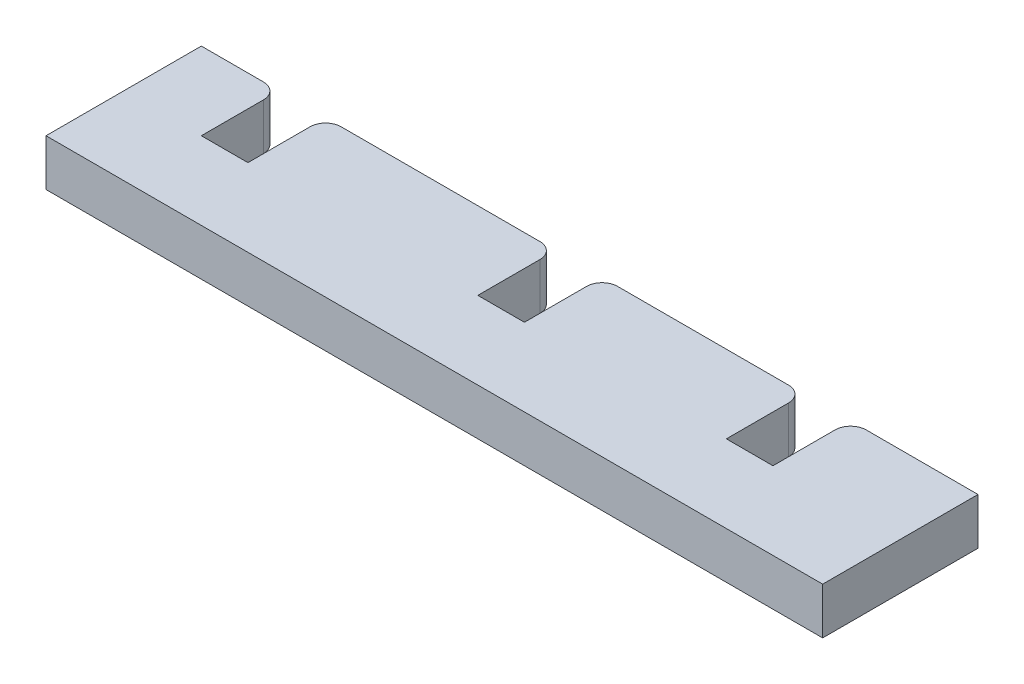
ISO-10303-21;
HEADER;
FILE_DESCRIPTION(('STEP AP214'),'2;1');
FILE_NAME('part.step','',(''),(''),'','','');
FILE_SCHEMA(('AUTOMOTIVE_DESIGN { 1 0 10303 214 1 1 1 1 }'));
ENDSEC;
DATA;
#1=APPLICATION_CONTEXT('core data for automotive mechanical design processes');
#2=APPLICATION_PROTOCOL_DEFINITION('international standard','automotive_design',2000,#1);
#3=PRODUCT_CONTEXT('',#1,'mechanical');
#4=PRODUCT('Part','Part','',(#3));
#5=PRODUCT_RELATED_PRODUCT_CATEGORY('part','',(#4));
#6=PRODUCT_DEFINITION_FORMATION('','',#4);
#7=PRODUCT_DEFINITION_CONTEXT('part definition',#1,'design');
#8=PRODUCT_DEFINITION('design','',#6,#7);
#9=PRODUCT_DEFINITION_SHAPE('','',#8);
#10=(LENGTH_UNIT() NAMED_UNIT(*) SI_UNIT(.MILLI.,.METRE.));
#11=(NAMED_UNIT(*) PLANE_ANGLE_UNIT() SI_UNIT($,.RADIAN.));
#12=(NAMED_UNIT(*) SI_UNIT($,.STERADIAN.) SOLID_ANGLE_UNIT());
#13=UNCERTAINTY_MEASURE_WITH_UNIT(LENGTH_MEASURE(1.E-05),#10,'distance_accuracy_value','');
#14=(GEOMETRIC_REPRESENTATION_CONTEXT(3) GLOBAL_UNCERTAINTY_ASSIGNED_CONTEXT((#13)) GLOBAL_UNIT_ASSIGNED_CONTEXT((#10,
#11,#12)) REPRESENTATION_CONTEXT('',''));
#15=CARTESIAN_POINT('',(0.,0.,0.));
#16=DIRECTION('',(0.,0.,1.));
#17=DIRECTION('',(1.,0.,0.));
#18=AXIS2_PLACEMENT_3D('',#15,#16,#17);
#19=CARTESIAN_POINT('',(0.,0.,0.));
#20=DIRECTION('',(0.,0.,-1.));
#21=DIRECTION('',(-1.,0.,0.));
#22=AXIS2_PLACEMENT_3D('',#19,#20,#21);
#23=PLANE('',#22);
#24=DIRECTION('',(1.,0.,0.));
#25=VECTOR('',#24,1.);
#26=CARTESIAN_POINT('',(0.,0.,0.));
#27=LINE('',#26,#25);
#28=CARTESIAN_POINT('',(42.8,0.,0.));
#29=VERTEX_POINT('',#28);
#30=CARTESIAN_POINT('',(50.,0.,0.));
#31=VERTEX_POINT('',#30);
#32=EDGE_CURVE('E273',#29,#31,#27,.T.);
#33=ORIENTED_EDGE('',*,*,#32,.F.);
#34=DIRECTION('',(0.,-1.,0.));
#35=VECTOR('',#34,1.);
#36=CARTESIAN_POINT('',(42.8,3.,0.));
#37=LINE('',#36,#35);
#38=CARTESIAN_POINT('',(42.8,3.,0.));
#39=VERTEX_POINT('',#38);
#40=EDGE_CURVE('E11',#29,#39,#37,.F.);
#41=ORIENTED_EDGE('',*,*,#40,.T.);
#42=DIRECTION('',(-1.,0.,0.));
#43=VECTOR('',#42,1.);
#44=CARTESIAN_POINT('',(0.,3.,0.));
#45=LINE('',#44,#43);
#46=CARTESIAN_POINT('',(50.,3.,0.));
#47=VERTEX_POINT('',#46);
#48=EDGE_CURVE('E263',#47,#39,#45,.T.);
#49=ORIENTED_EDGE('',*,*,#48,.F.);
#50=DIRECTION('',(0.,1.,0.));
#51=VECTOR('',#50,1.);
#52=CARTESIAN_POINT('',(50.,0.,0.));
#53=LINE('',#52,#51);
#54=EDGE_CURVE('E277',#31,#47,#53,.T.);
#55=ORIENTED_EDGE('',*,*,#54,.F.);
#56=EDGE_LOOP('',(#33,#41,#49,#55));
#57=FACE_BOUND('',#56,.T.);
#58=ADVANCED_FACE('F35',(#57),#23,.T.);
#59=CARTESIAN_POINT('',(26.8,0.,0.));
#60=VERTEX_POINT('',#59);
#61=CARTESIAN_POINT('',(37.8,0.,0.));
#62=VERTEX_POINT('',#61);
#63=EDGE_CURVE('E279',#60,#62,#27,.T.);
#64=ORIENTED_EDGE('',*,*,#63,.F.);
#65=DIRECTION('',(0.,-1.,0.));
#66=VECTOR('',#65,1.);
#67=CARTESIAN_POINT('',(26.8,3.,0.));
#68=LINE('',#67,#66);
#69=CARTESIAN_POINT('',(26.8,3.,0.));
#70=VERTEX_POINT('',#69);
#71=EDGE_CURVE('E338',#60,#70,#68,.F.);
#72=ORIENTED_EDGE('',*,*,#71,.T.);
#73=CARTESIAN_POINT('',(37.8,3.,0.));
#74=VERTEX_POINT('',#73);
#75=EDGE_CURVE('E284',#74,#70,#45,.T.);
#76=ORIENTED_EDGE('',*,*,#75,.F.);
#77=DIRECTION('',(0.,1.,0.));
#78=VECTOR('',#77,1.);
#79=CARTESIAN_POINT('',(37.8,0.,0.));
#80=LINE('',#79,#78);
#81=EDGE_CURVE('E58',#74,#62,#80,.F.);
#82=ORIENTED_EDGE('',*,*,#81,.T.);
#83=EDGE_LOOP('',(#64,#72,#76,#82));
#84=FACE_BOUND('',#83,.T.);
#85=ADVANCED_FACE('F384',(#84),#23,.T.);
#86=CARTESIAN_POINT('',(9.,0.,0.));
#87=VERTEX_POINT('',#86);
#88=CARTESIAN_POINT('',(21.8,0.,0.));
#89=VERTEX_POINT('',#88);
#90=EDGE_CURVE('E278',#87,#89,#27,.T.);
#91=ORIENTED_EDGE('',*,*,#90,.F.);
#92=DIRECTION('',(0.,-1.,0.));
#93=VECTOR('',#92,1.);
#94=CARTESIAN_POINT('',(9.,3.,0.));
#95=LINE('',#94,#93);
#96=CARTESIAN_POINT('',(9.,3.,0.));
#97=VERTEX_POINT('',#96);
#98=EDGE_CURVE('E329',#87,#97,#95,.F.);
#99=ORIENTED_EDGE('',*,*,#98,.T.);
#100=CARTESIAN_POINT('',(21.8,3.,0.));
#101=VERTEX_POINT('',#100);
#102=EDGE_CURVE('E388',#101,#97,#45,.T.);
#103=ORIENTED_EDGE('',*,*,#102,.F.);
#104=DIRECTION('',(0.,1.,0.));
#105=VECTOR('',#104,1.);
#106=CARTESIAN_POINT('',(21.8,0.,0.));
#107=LINE('',#106,#105);
#108=EDGE_CURVE('E327',#101,#89,#107,.F.);
#109=ORIENTED_EDGE('',*,*,#108,.T.);
#110=EDGE_LOOP('',(#91,#99,#103,#109));
#111=FACE_BOUND('',#110,.T.);
#112=ADVANCED_FACE('F421',(#111),#23,.T.);
#113=CARTESIAN_POINT('',(0.,0.,10.));
#114=DIRECTION('',(1.,0.,0.));
#115=DIRECTION('',(0.,0.,-1.));
#116=AXIS2_PLACEMENT_3D('',#113,#114,#115);
#117=PLANE('',#116);
#118=DIRECTION('',(0.,-1.,0.));
#119=VECTOR('',#118,1.);
#120=CARTESIAN_POINT('',(0.,0.,0.));
#121=LINE('',#120,#119);
#122=CARTESIAN_POINT('',(0.,3.,0.));
#123=VERTEX_POINT('',#122);
#124=CARTESIAN_POINT('',(0.,0.,0.));
#125=VERTEX_POINT('',#124);
#126=EDGE_CURVE('E270',#123,#125,#121,.T.);
#127=ORIENTED_EDGE('',*,*,#126,.T.);
#128=DIRECTION('',(0.,0.,-1.));
#129=VECTOR('',#128,1.);
#130=CARTESIAN_POINT('',(0.,0.,10.));
#131=LINE('',#130,#129);
#132=CARTESIAN_POINT('',(0.,0.,10.));
#133=VERTEX_POINT('',#132);
#134=EDGE_CURVE('E293',#133,#125,#131,.T.);
#135=ORIENTED_EDGE('',*,*,#134,.F.);
#136=DIRECTION('',(0.,-1.,0.));
#137=VECTOR('',#136,1.);
#138=CARTESIAN_POINT('',(0.,0.,10.));
#139=LINE('',#138,#137);
#140=CARTESIAN_POINT('',(0.,3.,10.));
#141=VERTEX_POINT('',#140);
#142=EDGE_CURVE('E259',#141,#133,#139,.T.);
#143=ORIENTED_EDGE('',*,*,#142,.F.);
#144=DIRECTION('',(0.,0.,-1.));
#145=VECTOR('',#144,1.);
#146=CARTESIAN_POINT('',(0.,3.,10.));
#147=LINE('',#146,#145);
#148=EDGE_CURVE('E269',#141,#123,#147,.T.);
#149=ORIENTED_EDGE('',*,*,#148,.T.);
#150=EDGE_LOOP('',(#127,#135,#143,#149));
#151=FACE_BOUND('',#150,.T.);
#152=ADVANCED_FACE('F398',(#151),#117,.F.);
#153=CARTESIAN_POINT('',(0.,0.,10.));
#154=DIRECTION('',(0.,1.,0.));
#155=DIRECTION('',(0.,0.,1.));
#156=AXIS2_PLACEMENT_3D('',#153,#154,#155);
#157=PLANE('',#156);
#158=CARTESIAN_POINT('',(4.,0.,0.));
#159=VERTEX_POINT('',#158);
#160=EDGE_CURVE('E275',#125,#159,#27,.T.);
#161=ORIENTED_EDGE('',*,*,#160,.T.);
#162=CARTESIAN_POINT('',(4.,0.,1.));
#163=DIRECTION('',(0.,1.,0.));
#164=DIRECTION('',(0.,0.,1.));
#165=AXIS2_PLACEMENT_3D('',#162,#163,#164);
#166=CIRCLE('',#165,1.);
#167=CARTESIAN_POINT('',(5.,0.,1.));
#168=VERTEX_POINT('',#167);
#169=EDGE_CURVE('E322',#159,#168,#166,.F.);
#170=ORIENTED_EDGE('',*,*,#169,.T.);
#171=DIRECTION('',(0.,0.,-1.));
#172=VECTOR('',#171,1.);
#173=CARTESIAN_POINT('',(5.,0.,5.));
#174=LINE('',#173,#172);
#175=CARTESIAN_POINT('',(5.,0.,5.));
#176=VERTEX_POINT('',#175);
#177=EDGE_CURVE('E248',#176,#168,#174,.T.);
#178=ORIENTED_EDGE('',*,*,#177,.F.);
#179=DIRECTION('',(-1.,0.,0.));
#180=VECTOR('',#179,1.);
#181=CARTESIAN_POINT('',(5.,0.,5.));
#182=LINE('',#181,#180);
#183=CARTESIAN_POINT('',(8.,0.,5.));
#184=VERTEX_POINT('',#183);
#185=EDGE_CURVE('E237',#184,#176,#182,.T.);
#186=ORIENTED_EDGE('',*,*,#185,.F.);
#187=DIRECTION('',(0.,0.,-1.));
#188=VECTOR('',#187,1.);
#189=CARTESIAN_POINT('',(8.,0.,5.));
#190=LINE('',#189,#188);
#191=CARTESIAN_POINT('',(8.,0.,1.));
#192=VERTEX_POINT('',#191);
#193=EDGE_CURVE('E218',#184,#192,#190,.T.);
#194=ORIENTED_EDGE('',*,*,#193,.T.);
#195=CARTESIAN_POINT('',(9.,0.,1.));
#196=DIRECTION('',(0.,1.,0.));
#197=DIRECTION('',(0.,0.,1.));
#198=AXIS2_PLACEMENT_3D('',#195,#196,#197);
#199=CIRCLE('',#198,1.);
#200=EDGE_CURVE('E320',#192,#87,#199,.F.);
#201=ORIENTED_EDGE('',*,*,#200,.T.);
#202=ORIENTED_EDGE('',*,*,#90,.T.);
#203=CARTESIAN_POINT('',(21.8,0.,1.));
#204=DIRECTION('',(0.,1.,0.));
#205=DIRECTION('',(0.,0.,1.));
#206=AXIS2_PLACEMENT_3D('',#203,#204,#205);
#207=CIRCLE('',#206,1.);
#208=CARTESIAN_POINT('',(22.8,0.,1.));
#209=VERTEX_POINT('',#208);
#210=EDGE_CURVE('E318',#89,#209,#207,.F.);
#211=ORIENTED_EDGE('',*,*,#210,.T.);
#212=DIRECTION('',(0.,0.,-1.));
#213=VECTOR('',#212,1.);
#214=CARTESIAN_POINT('',(22.8,0.,5.));
#215=LINE('',#214,#213);
#216=CARTESIAN_POINT('',(22.8,0.,5.));
#217=VERTEX_POINT('',#216);
#218=EDGE_CURVE('E226',#217,#209,#215,.T.);
#219=ORIENTED_EDGE('',*,*,#218,.F.);
#220=DIRECTION('',(-1.,0.,0.));
#221=VECTOR('',#220,1.);
#222=CARTESIAN_POINT('',(22.8,0.,5.));
#223=LINE('',#222,#221);
#224=CARTESIAN_POINT('',(25.8,0.,5.));
#225=VERTEX_POINT('',#224);
#226=EDGE_CURVE('E214',#225,#217,#223,.T.);
#227=ORIENTED_EDGE('',*,*,#226,.F.);
#228=DIRECTION('',(0.,0.,-1.));
#229=VECTOR('',#228,1.);
#230=CARTESIAN_POINT('',(25.8,0.,5.));
#231=LINE('',#230,#229);
#232=CARTESIAN_POINT('',(25.8,0.,1.));
#233=VERTEX_POINT('',#232);
#234=EDGE_CURVE('E204',#225,#233,#231,.T.);
#235=ORIENTED_EDGE('',*,*,#234,.T.);
#236=CARTESIAN_POINT('',(26.8,0.,1.));
#237=DIRECTION('',(0.,1.,0.));
#238=DIRECTION('',(0.,0.,1.));
#239=AXIS2_PLACEMENT_3D('',#236,#237,#238);
#240=CIRCLE('',#239,1.);
#241=EDGE_CURVE('E316',#233,#60,#240,.F.);
#242=ORIENTED_EDGE('',*,*,#241,.T.);
#243=ORIENTED_EDGE('',*,*,#63,.T.);
#244=CARTESIAN_POINT('',(37.8,0.,1.));
#245=DIRECTION('',(0.,1.,0.));
#246=DIRECTION('',(0.,0.,1.));
#247=AXIS2_PLACEMENT_3D('',#244,#245,#246);
#248=CIRCLE('',#247,1.);
#249=CARTESIAN_POINT('',(38.8,0.,1.));
#250=VERTEX_POINT('',#249);
#251=EDGE_CURVE('E50',#62,#250,#248,.F.);
#252=ORIENTED_EDGE('',*,*,#251,.T.);
#253=DIRECTION('',(0.,0.,-1.));
#254=VECTOR('',#253,1.);
#255=CARTESIAN_POINT('',(38.8,0.,5.));
#256=LINE('',#255,#254);
#257=CARTESIAN_POINT('',(38.8,0.,5.));
#258=VERTEX_POINT('',#257);
#259=EDGE_CURVE('E189',#258,#250,#256,.T.);
#260=ORIENTED_EDGE('',*,*,#259,.F.);
#261=DIRECTION('',(-1.,0.,0.));
#262=VECTOR('',#261,1.);
#263=CARTESIAN_POINT('',(38.8,0.,5.));
#264=LINE('',#263,#262);
#265=CARTESIAN_POINT('',(41.8,0.,5.));
#266=VERTEX_POINT('',#265);
#267=EDGE_CURVE('E196',#266,#258,#264,.T.);
#268=ORIENTED_EDGE('',*,*,#267,.F.);
#269=DIRECTION('',(0.,0.,-1.));
#270=VECTOR('',#269,1.);
#271=CARTESIAN_POINT('',(41.8,0.,5.));
#272=LINE('',#271,#270);
#273=CARTESIAN_POINT('',(41.8,0.,1.));
#274=VERTEX_POINT('',#273);
#275=EDGE_CURVE('E274',#266,#274,#272,.T.);
#276=ORIENTED_EDGE('',*,*,#275,.T.);
#277=CARTESIAN_POINT('',(42.8,0.,1.));
#278=DIRECTION('',(0.,1.,0.));
#279=DIRECTION('',(0.,0.,1.));
#280=AXIS2_PLACEMENT_3D('',#277,#278,#279);
#281=CIRCLE('',#280,1.);
#282=EDGE_CURVE('E313',#274,#29,#281,.F.);
#283=ORIENTED_EDGE('',*,*,#282,.T.);
#284=ORIENTED_EDGE('',*,*,#32,.T.);
#285=DIRECTION('',(0.,0.,-1.));
#286=VECTOR('',#285,1.);
#287=CARTESIAN_POINT('',(50.,0.,10.));
#288=LINE('',#287,#286);
#289=CARTESIAN_POINT('',(50.,0.,10.));
#290=VERTEX_POINT('',#289);
#291=EDGE_CURVE('E290',#290,#31,#288,.T.);
#292=ORIENTED_EDGE('',*,*,#291,.F.);
#293=DIRECTION('',(1.,0.,0.));
#294=VECTOR('',#293,1.);
#295=CARTESIAN_POINT('',(0.,0.,10.));
#296=LINE('',#295,#294);
#297=EDGE_CURVE('E262',#133,#290,#296,.T.);
#298=ORIENTED_EDGE('',*,*,#297,.F.);
#299=ORIENTED_EDGE('',*,*,#134,.T.);
#300=EDGE_LOOP('',(#161,#170,#178,#186,#194,#201,#202,#211,#219,#227,#235,#242,#243,#252,#260,
#268,#276,#283,#284,#292,#298,#299));
#301=FACE_BOUND('',#300,.T.);
#302=ADVANCED_FACE('F207',(#301),#157,.F.);
#303=CARTESIAN_POINT('',(50.,0.,10.));
#304=DIRECTION('',(-1.,0.,0.));
#305=DIRECTION('',(0.,0.,1.));
#306=AXIS2_PLACEMENT_3D('',#303,#304,#305);
#307=PLANE('',#306);
#308=ORIENTED_EDGE('',*,*,#54,.T.);
#309=DIRECTION('',(0.,0.,-1.));
#310=VECTOR('',#309,1.);
#311=CARTESIAN_POINT('',(50.,3.,10.));
#312=LINE('',#311,#310);
#313=CARTESIAN_POINT('',(50.,3.,10.));
#314=VERTEX_POINT('',#313);
#315=EDGE_CURVE('E287',#314,#47,#312,.T.);
#316=ORIENTED_EDGE('',*,*,#315,.F.);
#317=DIRECTION('',(0.,1.,0.));
#318=VECTOR('',#317,1.);
#319=CARTESIAN_POINT('',(50.,0.,10.));
#320=LINE('',#319,#318);
#321=EDGE_CURVE('E265',#290,#314,#320,.T.);
#322=ORIENTED_EDGE('',*,*,#321,.F.);
#323=ORIENTED_EDGE('',*,*,#291,.T.);
#324=EDGE_LOOP('',(#308,#316,#322,#323));
#325=FACE_BOUND('',#324,.T.);
#326=ADVANCED_FACE('F407',(#325),#307,.F.);
#327=CARTESIAN_POINT('',(0.,3.,10.));
#328=DIRECTION('',(0.,-1.,0.));
#329=DIRECTION('',(0.,0.,-1.));
#330=AXIS2_PLACEMENT_3D('',#327,#328,#329);
#331=PLANE('',#330);
#332=DIRECTION('',(0.,0.,-1.));
#333=VECTOR('',#332,1.);
#334=CARTESIAN_POINT('',(5.,3.,5.));
#335=LINE('',#334,#333);
#336=CARTESIAN_POINT('',(5.,3.,5.));
#337=VERTEX_POINT('',#336);
#338=CARTESIAN_POINT('',(5.,3.,1.));
#339=VERTEX_POINT('',#338);
#340=EDGE_CURVE('E254',#337,#339,#335,.T.);
#341=ORIENTED_EDGE('',*,*,#340,.T.);
#342=CARTESIAN_POINT('',(4.,3.,1.));
#343=DIRECTION('',(0.,-1.,0.));
#344=DIRECTION('',(0.,0.,-1.));
#345=AXIS2_PLACEMENT_3D('',#342,#343,#344);
#346=CIRCLE('',#345,1.);
#347=CARTESIAN_POINT('',(4.,3.,0.));
#348=VERTEX_POINT('',#347);
#349=EDGE_CURVE('E309',#339,#348,#346,.F.);
#350=ORIENTED_EDGE('',*,*,#349,.T.);
#351=EDGE_CURVE('E281',#348,#123,#45,.T.);
#352=ORIENTED_EDGE('',*,*,#351,.T.);
#353=ORIENTED_EDGE('',*,*,#148,.F.);
#354=DIRECTION('',(-1.,0.,0.));
#355=VECTOR('',#354,1.);
#356=CARTESIAN_POINT('',(0.,3.,10.));
#357=LINE('',#356,#355);
#358=EDGE_CURVE('E267',#314,#141,#357,.T.);
#359=ORIENTED_EDGE('',*,*,#358,.F.);
#360=ORIENTED_EDGE('',*,*,#315,.T.);
#361=ORIENTED_EDGE('',*,*,#48,.T.);
#362=CARTESIAN_POINT('',(42.8,3.,1.));
#363=DIRECTION('',(0.,-1.,0.));
#364=DIRECTION('',(0.,0.,-1.));
#365=AXIS2_PLACEMENT_3D('',#362,#363,#364);
#366=CIRCLE('',#365,1.);
#367=CARTESIAN_POINT('',(41.8,3.,1.));
#368=VERTEX_POINT('',#367);
#369=EDGE_CURVE('E299',#39,#368,#366,.F.);
#370=ORIENTED_EDGE('',*,*,#369,.T.);
#371=DIRECTION('',(0.,0.,-1.));
#372=VECTOR('',#371,1.);
#373=CARTESIAN_POINT('',(41.8,3.,5.));
#374=LINE('',#373,#372);
#375=CARTESIAN_POINT('',(41.8,3.,5.));
#376=VERTEX_POINT('',#375);
#377=EDGE_CURVE('E209',#376,#368,#374,.T.);
#378=ORIENTED_EDGE('',*,*,#377,.F.);
#379=DIRECTION('',(1.,0.,0.));
#380=VECTOR('',#379,1.);
#381=CARTESIAN_POINT('',(41.8,3.,5.));
#382=LINE('',#381,#380);
#383=CARTESIAN_POINT('',(38.8,3.,5.));
#384=VERTEX_POINT('',#383);
#385=EDGE_CURVE('E195',#384,#376,#382,.T.);
#386=ORIENTED_EDGE('',*,*,#385,.F.);
#387=DIRECTION('',(0.,0.,-1.));
#388=VECTOR('',#387,1.);
#389=CARTESIAN_POINT('',(38.8,3.,5.));
#390=LINE('',#389,#388);
#391=CARTESIAN_POINT('',(38.8,3.,1.));
#392=VERTEX_POINT('',#391);
#393=EDGE_CURVE('E192',#384,#392,#390,.T.);
#394=ORIENTED_EDGE('',*,*,#393,.T.);
#395=CARTESIAN_POINT('',(37.8,3.,1.));
#396=DIRECTION('',(0.,-1.,0.));
#397=DIRECTION('',(0.,0.,-1.));
#398=AXIS2_PLACEMENT_3D('',#395,#396,#397);
#399=CIRCLE('',#398,1.);
#400=EDGE_CURVE('E301',#392,#74,#399,.F.);
#401=ORIENTED_EDGE('',*,*,#400,.T.);
#402=ORIENTED_EDGE('',*,*,#75,.T.);
#403=CARTESIAN_POINT('',(26.8,3.,1.));
#404=DIRECTION('',(0.,-1.,0.));
#405=DIRECTION('',(0.,0.,-1.));
#406=AXIS2_PLACEMENT_3D('',#403,#404,#405);
#407=CIRCLE('',#406,1.);
#408=CARTESIAN_POINT('',(25.8,3.,1.));
#409=VERTEX_POINT('',#408);
#410=EDGE_CURVE('E303',#70,#409,#407,.F.);
#411=ORIENTED_EDGE('',*,*,#410,.T.);
#412=DIRECTION('',(0.,0.,-1.));
#413=VECTOR('',#412,1.);
#414=CARTESIAN_POINT('',(25.8,3.,5.));
#415=LINE('',#414,#413);
#416=CARTESIAN_POINT('',(25.8,3.,5.));
#417=VERTEX_POINT('',#416);
#418=EDGE_CURVE('E229',#417,#409,#415,.T.);
#419=ORIENTED_EDGE('',*,*,#418,.F.);
#420=DIRECTION('',(1.,0.,0.));
#421=VECTOR('',#420,1.);
#422=CARTESIAN_POINT('',(25.8,3.,5.));
#423=LINE('',#422,#421);
#424=CARTESIAN_POINT('',(22.8,3.,5.));
#425=VERTEX_POINT('',#424);
#426=EDGE_CURVE('E221',#425,#417,#423,.T.);
#427=ORIENTED_EDGE('',*,*,#426,.F.);
#428=DIRECTION('',(0.,0.,-1.));
#429=VECTOR('',#428,1.);
#430=CARTESIAN_POINT('',(22.8,3.,5.));
#431=LINE('',#430,#429);
#432=CARTESIAN_POINT('',(22.8,3.,1.));
#433=VERTEX_POINT('',#432);
#434=EDGE_CURVE('E232',#425,#433,#431,.T.);
#435=ORIENTED_EDGE('',*,*,#434,.T.);
#436=CARTESIAN_POINT('',(21.8,3.,1.));
#437=DIRECTION('',(0.,-1.,0.));
#438=DIRECTION('',(0.,0.,-1.));
#439=AXIS2_PLACEMENT_3D('',#436,#437,#438);
#440=CIRCLE('',#439,1.);
#441=EDGE_CURVE('E305',#433,#101,#440,.F.);
#442=ORIENTED_EDGE('',*,*,#441,.T.);
#443=ORIENTED_EDGE('',*,*,#102,.T.);
#444=CARTESIAN_POINT('',(9.,3.,1.));
#445=DIRECTION('',(0.,-1.,0.));
#446=DIRECTION('',(0.,0.,-1.));
#447=AXIS2_PLACEMENT_3D('',#444,#445,#446);
#448=CIRCLE('',#447,1.);
#449=CARTESIAN_POINT('',(8.,3.,1.));
#450=VERTEX_POINT('',#449);
#451=EDGE_CURVE('E307',#97,#450,#448,.F.);
#452=ORIENTED_EDGE('',*,*,#451,.T.);
#453=DIRECTION('',(0.,0.,-1.));
#454=VECTOR('',#453,1.);
#455=CARTESIAN_POINT('',(8.,3.,5.));
#456=LINE('',#455,#454);
#457=CARTESIAN_POINT('',(8.,3.,5.));
#458=VERTEX_POINT('',#457);
#459=EDGE_CURVE('E251',#458,#450,#456,.T.);
#460=ORIENTED_EDGE('',*,*,#459,.F.);
#461=DIRECTION('',(1.,0.,0.));
#462=VECTOR('',#461,1.);
#463=CARTESIAN_POINT('',(8.,3.,5.));
#464=LINE('',#463,#462);
#465=EDGE_CURVE('E243',#337,#458,#464,.T.);
#466=ORIENTED_EDGE('',*,*,#465,.F.);
#467=EDGE_LOOP('',(#341,#350,#352,#353,#359,#360,#361,#370,#378,#386,#394,#401,#402,#411,#419,
#427,#435,#442,#443,#452,#460,#466));
#468=FACE_BOUND('',#467,.T.);
#469=ADVANCED_FACE('F353',(#468),#331,.F.);
#470=CARTESIAN_POINT('',(0.,0.,10.));
#471=DIRECTION('',(0.,0.,-1.));
#472=DIRECTION('',(-1.,0.,0.));
#473=AXIS2_PLACEMENT_3D('',#470,#471,#472);
#474=PLANE('',#473);
#475=ORIENTED_EDGE('',*,*,#142,.T.);
#476=ORIENTED_EDGE('',*,*,#297,.T.);
#477=ORIENTED_EDGE('',*,*,#321,.T.);
#478=ORIENTED_EDGE('',*,*,#358,.T.);
#479=EDGE_LOOP('',(#475,#476,#477,#478));
#480=FACE_BOUND('',#479,.T.);
#481=ADVANCED_FACE('F404',(#480),#474,.F.);
#482=ORIENTED_EDGE('',*,*,#351,.F.);
#483=DIRECTION('',(0.,1.,0.));
#484=VECTOR('',#483,1.);
#485=CARTESIAN_POINT('',(4.,0.,0.));
#486=LINE('',#485,#484);
#487=EDGE_CURVE('E311',#348,#159,#486,.F.);
#488=ORIENTED_EDGE('',*,*,#487,.T.);
#489=ORIENTED_EDGE('',*,*,#160,.F.);
#490=ORIENTED_EDGE('',*,*,#126,.F.);
#491=EDGE_LOOP('',(#482,#488,#489,#490));
#492=FACE_BOUND('',#491,.T.);
#493=ADVANCED_FACE('F400',(#492),#23,.T.);
#494=CARTESIAN_POINT('',(8.,3.,5.));
#495=DIRECTION('',(1.,0.,0.));
#496=DIRECTION('',(0.,0.,-1.));
#497=AXIS2_PLACEMENT_3D('',#494,#495,#496);
#498=PLANE('',#497);
#499=ORIENTED_EDGE('',*,*,#459,.T.);
#500=DIRECTION('',(0.,-1.,0.));
#501=VECTOR('',#500,1.);
#502=CARTESIAN_POINT('',(8.,0.,1.));
#503=LINE('',#502,#501);
#504=EDGE_CURVE('E324',#450,#192,#503,.T.);
#505=ORIENTED_EDGE('',*,*,#504,.T.);
#506=ORIENTED_EDGE('',*,*,#193,.F.);
#507=DIRECTION('',(0.,-1.,0.));
#508=VECTOR('',#507,1.);
#509=CARTESIAN_POINT('',(8.,3.,5.));
#510=LINE('',#509,#508);
#511=EDGE_CURVE('E245',#458,#184,#510,.T.);
#512=ORIENTED_EDGE('',*,*,#511,.F.);
#513=EDGE_LOOP('',(#499,#505,#506,#512));
#514=FACE_BOUND('',#513,.T.);
#515=ADVANCED_FACE('F424',(#514),#498,.F.);
#516=CARTESIAN_POINT('',(5.,3.,5.));
#517=DIRECTION('',(-1.,0.,0.));
#518=DIRECTION('',(0.,-1.,0.));
#519=AXIS2_PLACEMENT_3D('',#516,#517,#518);
#520=PLANE('',#519);
#521=ORIENTED_EDGE('',*,*,#177,.T.);
#522=DIRECTION('',(0.,1.,0.));
#523=VECTOR('',#522,1.);
#524=CARTESIAN_POINT('',(5.,3.,1.));
#525=LINE('',#524,#523);
#526=EDGE_CURVE('E296',#168,#339,#525,.T.);
#527=ORIENTED_EDGE('',*,*,#526,.T.);
#528=ORIENTED_EDGE('',*,*,#340,.F.);
#529=DIRECTION('',(0.,1.,0.));
#530=VECTOR('',#529,1.);
#531=CARTESIAN_POINT('',(5.,3.,5.));
#532=LINE('',#531,#530);
#533=EDGE_CURVE('E240',#176,#337,#532,.T.);
#534=ORIENTED_EDGE('',*,*,#533,.F.);
#535=EDGE_LOOP('',(#521,#527,#528,#534));
#536=FACE_BOUND('',#535,.T.);
#537=ADVANCED_FACE('F429',(#536),#520,.F.);
#538=CARTESIAN_POINT('',(0.,0.,5.));
#539=DIRECTION('',(0.,0.,-1.));
#540=DIRECTION('',(-1.,0.,0.));
#541=AXIS2_PLACEMENT_3D('',#538,#539,#540);
#542=PLANE('',#541);
#543=ORIENTED_EDGE('',*,*,#185,.T.);
#544=ORIENTED_EDGE('',*,*,#533,.T.);
#545=ORIENTED_EDGE('',*,*,#465,.T.);
#546=ORIENTED_EDGE('',*,*,#511,.T.);
#547=EDGE_LOOP('',(#543,#544,#545,#546));
#548=FACE_BOUND('',#547,.T.);
#549=ADVANCED_FACE('F526',(#548),#542,.T.);
#550=CARTESIAN_POINT('',(25.8,3.,5.));
#551=DIRECTION('',(1.,0.,0.));
#552=DIRECTION('',(0.,0.,-1.));
#553=AXIS2_PLACEMENT_3D('',#550,#551,#552);
#554=PLANE('',#553);
#555=ORIENTED_EDGE('',*,*,#418,.T.);
#556=DIRECTION('',(0.,-1.,0.));
#557=VECTOR('',#556,1.);
#558=CARTESIAN_POINT('',(25.8,0.,1.));
#559=LINE('',#558,#557);
#560=EDGE_CURVE('E334',#409,#233,#559,.T.);
#561=ORIENTED_EDGE('',*,*,#560,.T.);
#562=ORIENTED_EDGE('',*,*,#234,.F.);
#563=DIRECTION('',(0.,-1.,0.));
#564=VECTOR('',#563,1.);
#565=CARTESIAN_POINT('',(25.8,3.,5.));
#566=LINE('',#565,#564);
#567=EDGE_CURVE('E223',#417,#225,#566,.T.);
#568=ORIENTED_EDGE('',*,*,#567,.F.);
#569=EDGE_LOOP('',(#555,#561,#562,#568));
#570=FACE_BOUND('',#569,.T.);
#571=ADVANCED_FACE('F380',(#570),#554,.F.);
#572=CARTESIAN_POINT('',(22.8,3.,5.));
#573=DIRECTION('',(-1.,0.,0.));
#574=DIRECTION('',(0.,0.,1.));
#575=AXIS2_PLACEMENT_3D('',#572,#573,#574);
#576=PLANE('',#575);
#577=ORIENTED_EDGE('',*,*,#218,.T.);
#578=DIRECTION('',(0.,1.,0.));
#579=VECTOR('',#578,1.);
#580=CARTESIAN_POINT('',(22.8,3.,1.));
#581=LINE('',#580,#579);
#582=EDGE_CURVE('E331',#209,#433,#581,.T.);
#583=ORIENTED_EDGE('',*,*,#582,.T.);
#584=ORIENTED_EDGE('',*,*,#434,.F.);
#585=DIRECTION('',(0.,1.,0.));
#586=VECTOR('',#585,1.);
#587=CARTESIAN_POINT('',(22.8,3.,5.));
#588=LINE('',#587,#586);
#589=EDGE_CURVE('E217',#217,#425,#588,.T.);
#590=ORIENTED_EDGE('',*,*,#589,.F.);
#591=EDGE_LOOP('',(#577,#583,#584,#590));
#592=FACE_BOUND('',#591,.T.);
#593=ADVANCED_FACE('F370',(#592),#576,.F.);
#594=CARTESIAN_POINT('',(0.,0.,5.));
#595=DIRECTION('',(0.,0.,-1.));
#596=DIRECTION('',(-1.,0.,0.));
#597=AXIS2_PLACEMENT_3D('',#594,#595,#596);
#598=PLANE('',#597);
#599=ORIENTED_EDGE('',*,*,#226,.T.);
#600=ORIENTED_EDGE('',*,*,#589,.T.);
#601=ORIENTED_EDGE('',*,*,#426,.T.);
#602=ORIENTED_EDGE('',*,*,#567,.T.);
#603=EDGE_LOOP('',(#599,#600,#601,#602));
#604=FACE_BOUND('',#603,.T.);
#605=ADVANCED_FACE('F377',(#604),#598,.T.);
#606=CARTESIAN_POINT('',(41.8,3.,5.));
#607=DIRECTION('',(1.,0.,0.));
#608=DIRECTION('',(0.,0.,-1.));
#609=AXIS2_PLACEMENT_3D('',#606,#607,#608);
#610=PLANE('',#609);
#611=ORIENTED_EDGE('',*,*,#377,.T.);
#612=DIRECTION('',(0.,-1.,0.));
#613=VECTOR('',#612,1.);
#614=CARTESIAN_POINT('',(41.8,0.,1.));
#615=LINE('',#614,#613);
#616=EDGE_CURVE('E43',#368,#274,#615,.T.);
#617=ORIENTED_EDGE('',*,*,#616,.T.);
#618=ORIENTED_EDGE('',*,*,#275,.F.);
#619=DIRECTION('',(0.,-1.,0.));
#620=VECTOR('',#619,1.);
#621=CARTESIAN_POINT('',(41.8,3.,5.));
#622=LINE('',#621,#620);
#623=EDGE_CURVE('E202',#376,#266,#622,.T.);
#624=ORIENTED_EDGE('',*,*,#623,.F.);
#625=EDGE_LOOP('',(#611,#617,#618,#624));
#626=FACE_BOUND('',#625,.T.);
#627=ADVANCED_FACE('F345',(#626),#610,.F.);
#628=CARTESIAN_POINT('',(38.8,3.,5.));
#629=DIRECTION('',(-1.,0.,0.));
#630=DIRECTION('',(0.,0.,1.));
#631=AXIS2_PLACEMENT_3D('',#628,#629,#630);
#632=PLANE('',#631);
#633=ORIENTED_EDGE('',*,*,#259,.T.);
#634=DIRECTION('',(0.,1.,0.));
#635=VECTOR('',#634,1.);
#636=CARTESIAN_POINT('',(38.8,3.,1.));
#637=LINE('',#636,#635);
#638=EDGE_CURVE('E340',#250,#392,#637,.T.);
#639=ORIENTED_EDGE('',*,*,#638,.T.);
#640=ORIENTED_EDGE('',*,*,#393,.F.);
#641=DIRECTION('',(0.,1.,0.));
#642=VECTOR('',#641,1.);
#643=CARTESIAN_POINT('',(38.8,3.,5.));
#644=LINE('',#643,#642);
#645=EDGE_CURVE('E185',#258,#384,#644,.T.);
#646=ORIENTED_EDGE('',*,*,#645,.F.);
#647=EDGE_LOOP('',(#633,#639,#640,#646));
#648=FACE_BOUND('',#647,.T.);
#649=ADVANCED_FACE('F187',(#648),#632,.F.);
#650=CARTESIAN_POINT('',(0.,0.,5.));
#651=DIRECTION('',(0.,0.,-1.));
#652=DIRECTION('',(-1.,0.,0.));
#653=AXIS2_PLACEMENT_3D('',#650,#651,#652);
#654=PLANE('',#653);
#655=ORIENTED_EDGE('',*,*,#267,.T.);
#656=ORIENTED_EDGE('',*,*,#645,.T.);
#657=ORIENTED_EDGE('',*,*,#385,.T.);
#658=ORIENTED_EDGE('',*,*,#623,.T.);
#659=EDGE_LOOP('',(#655,#656,#657,#658));
#660=FACE_BOUND('',#659,.T.);
#661=ADVANCED_FACE('F200',(#660),#654,.T.);
#662=CARTESIAN_POINT('',(4.,3.,1.));
#663=DIRECTION('',(0.,-1.,0.));
#664=DIRECTION('',(1.,0.,0.));
#665=AXIS2_PLACEMENT_3D('',#662,#663,#664);
#666=CYLINDRICAL_SURFACE('',#665,1.);
#667=ORIENTED_EDGE('',*,*,#169,.F.);
#668=ORIENTED_EDGE('',*,*,#487,.F.);
#669=ORIENTED_EDGE('',*,*,#349,.F.);
#670=ORIENTED_EDGE('',*,*,#526,.F.);
#671=EDGE_LOOP('',(#667,#668,#669,#670));
#672=FACE_BOUND('',#671,.T.);
#673=ADVANCED_FACE('F440',(#672),#666,.T.);
#674=CARTESIAN_POINT('',(9.,3.,1.));
#675=DIRECTION('',(0.,1.,0.));
#676=DIRECTION('',(0.,0.,1.));
#677=AXIS2_PLACEMENT_3D('',#674,#675,#676);
#678=CYLINDRICAL_SURFACE('',#677,1.);
#679=ORIENTED_EDGE('',*,*,#451,.F.);
#680=ORIENTED_EDGE('',*,*,#98,.F.);
#681=ORIENTED_EDGE('',*,*,#200,.F.);
#682=ORIENTED_EDGE('',*,*,#504,.F.);
#683=EDGE_LOOP('',(#679,#680,#681,#682));
#684=FACE_BOUND('',#683,.T.);
#685=ADVANCED_FACE('F443',(#684),#678,.T.);
#686=CARTESIAN_POINT('',(21.8,3.,1.));
#687=DIRECTION('',(0.,-1.,0.));
#688=DIRECTION('',(0.,0.,-1.));
#689=AXIS2_PLACEMENT_3D('',#686,#687,#688);
#690=CYLINDRICAL_SURFACE('',#689,1.);
#691=ORIENTED_EDGE('',*,*,#210,.F.);
#692=ORIENTED_EDGE('',*,*,#108,.F.);
#693=ORIENTED_EDGE('',*,*,#441,.F.);
#694=ORIENTED_EDGE('',*,*,#582,.F.);
#695=EDGE_LOOP('',(#691,#692,#693,#694));
#696=FACE_BOUND('',#695,.T.);
#697=ADVANCED_FACE('F368',(#696),#690,.T.);
#698=CARTESIAN_POINT('',(26.8,3.,1.));
#699=DIRECTION('',(0.,1.,0.));
#700=DIRECTION('',(0.,0.,1.));
#701=AXIS2_PLACEMENT_3D('',#698,#699,#700);
#702=CYLINDRICAL_SURFACE('',#701,1.);
#703=ORIENTED_EDGE('',*,*,#410,.F.);
#704=ORIENTED_EDGE('',*,*,#71,.F.);
#705=ORIENTED_EDGE('',*,*,#241,.F.);
#706=ORIENTED_EDGE('',*,*,#560,.F.);
#707=EDGE_LOOP('',(#703,#704,#705,#706));
#708=FACE_BOUND('',#707,.T.);
#709=ADVANCED_FACE('F387',(#708),#702,.T.);
#710=CARTESIAN_POINT('',(37.8,3.,1.));
#711=DIRECTION('',(0.,-1.,0.));
#712=DIRECTION('',(0.,0.,-1.));
#713=AXIS2_PLACEMENT_3D('',#710,#711,#712);
#714=CYLINDRICAL_SURFACE('',#713,1.);
#715=ORIENTED_EDGE('',*,*,#251,.F.);
#716=ORIENTED_EDGE('',*,*,#81,.F.);
#717=ORIENTED_EDGE('',*,*,#400,.F.);
#718=ORIENTED_EDGE('',*,*,#638,.F.);
#719=EDGE_LOOP('',(#715,#716,#717,#718));
#720=FACE_BOUND('',#719,.T.);
#721=ADVANCED_FACE('F451',(#720),#714,.T.);
#722=CARTESIAN_POINT('',(42.8,3.,1.));
#723=DIRECTION('',(0.,1.,0.));
#724=DIRECTION('',(0.,0.,1.));
#725=AXIS2_PLACEMENT_3D('',#722,#723,#724);
#726=CYLINDRICAL_SURFACE('',#725,1.);
#727=ORIENTED_EDGE('',*,*,#369,.F.);
#728=ORIENTED_EDGE('',*,*,#40,.F.);
#729=ORIENTED_EDGE('',*,*,#282,.F.);
#730=ORIENTED_EDGE('',*,*,#616,.F.);
#731=EDGE_LOOP('',(#727,#728,#729,#730));
#732=FACE_BOUND('',#731,.T.);
#733=ADVANCED_FACE('F37',(#732),#726,.T.);
#734=CLOSED_SHELL('',(#58,#85,#112,#152,#302,#326,#469,#481,#493,#515,#537,#549,#571,#593,#605,
#627,#649,#661,#673,#685,#697,#709,#721,#733));
#735=MANIFOLD_SOLID_BREP('B2',#734);
#736=ADVANCED_BREP_SHAPE_REPRESENTATION('',(#18,#735),#14);
#737=SHAPE_DEFINITION_REPRESENTATION(#9,#736);
ENDSEC;
END-ISO-10303-21;
